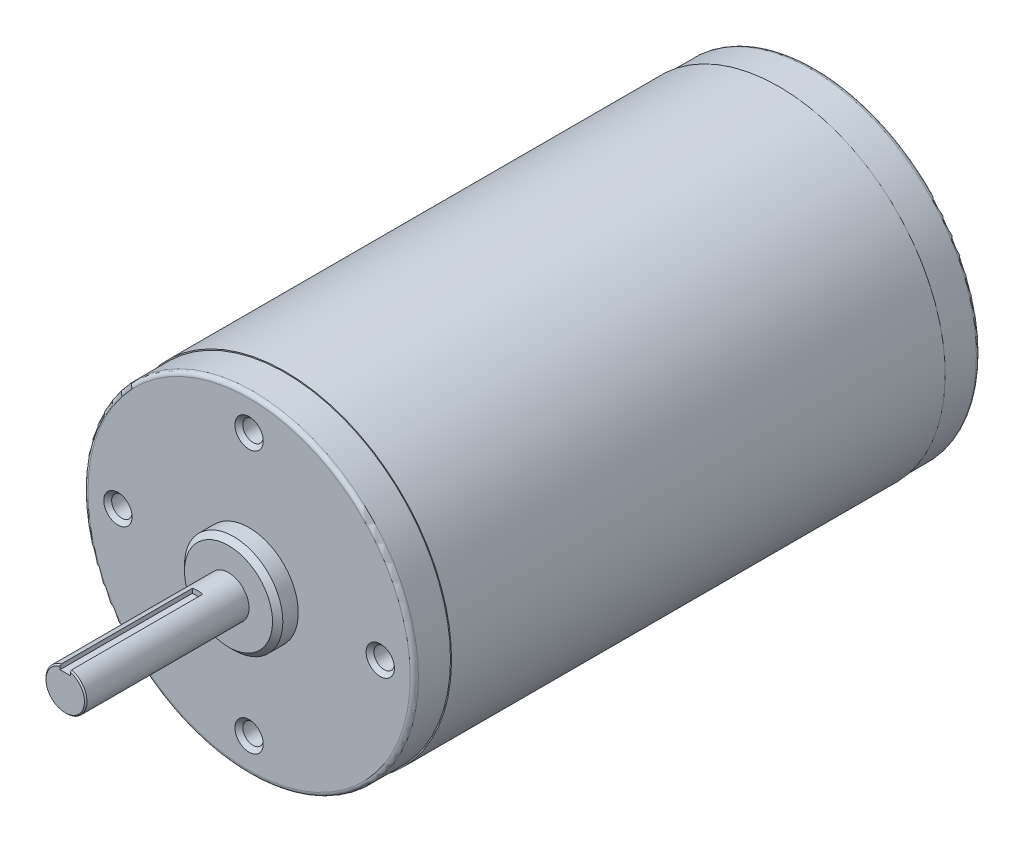
ISO-10303-21;
HEADER;
FILE_DESCRIPTION(('STEP AP214'),'2;1');
FILE_NAME('part.step','',(''),(''),'','','');
FILE_SCHEMA(('AUTOMOTIVE_DESIGN { 1 0 10303 214 1 1 1 1 }'));
ENDSEC;
DATA;
#1=APPLICATION_CONTEXT('core data for automotive mechanical design processes');
#2=APPLICATION_PROTOCOL_DEFINITION('international standard','automotive_design',2000,#1);
#3=PRODUCT_CONTEXT('',#1,'mechanical');
#4=PRODUCT('Part','Part','',(#3));
#5=PRODUCT_RELATED_PRODUCT_CATEGORY('part','',(#4));
#6=PRODUCT_DEFINITION_FORMATION('','',#4);
#7=PRODUCT_DEFINITION_CONTEXT('part definition',#1,'design');
#8=PRODUCT_DEFINITION('design','',#6,#7);
#9=PRODUCT_DEFINITION_SHAPE('','',#8);
#10=(LENGTH_UNIT() NAMED_UNIT(*) SI_UNIT(.MILLI.,.METRE.));
#11=(NAMED_UNIT(*) PLANE_ANGLE_UNIT() SI_UNIT($,.RADIAN.));
#12=(NAMED_UNIT(*) SI_UNIT($,.STERADIAN.) SOLID_ANGLE_UNIT());
#13=UNCERTAINTY_MEASURE_WITH_UNIT(LENGTH_MEASURE(1.E-05),#10,'distance_accuracy_value','');
#14=(GEOMETRIC_REPRESENTATION_CONTEXT(3) GLOBAL_UNCERTAINTY_ASSIGNED_CONTEXT((#13)) GLOBAL_UNIT_ASSIGNED_CONTEXT((#10,
#11,#12)) REPRESENTATION_CONTEXT('',''));
#15=CARTESIAN_POINT('',(0.,0.,0.));
#16=DIRECTION('',(0.,0.,1.));
#17=DIRECTION('',(1.,0.,0.));
#18=AXIS2_PLACEMENT_3D('',#15,#16,#17);
#19=CARTESIAN_POINT('',(15.74419,-15.74419,-106.7204));
#20=DIRECTION('',(0.,0.,-1.));
#21=DIRECTION('',(-1.,0.,0.));
#22=AXIS2_PLACEMENT_3D('',#19,#20,#21);
#23=PLANE('',#22);
#24=CARTESIAN_POINT('',(0.,0.,-106.7204));
#25=DIRECTION('',(0.,0.,1.));
#26=DIRECTION('',(-1.,0.,0.));
#27=AXIS2_PLACEMENT_3D('',#24,#25,#26);
#28=CIRCLE('',#27,14.3129);
#29=CARTESIAN_POINT('',(-14.3129,0.,-106.7204));
#30=VERTEX_POINT('',#29);
#31=EDGE_CURVE('E34',#30,#30,#28,.T.);
#32=ORIENTED_EDGE('',*,*,#31,.F.);
#33=EDGE_LOOP('',(#32));
#34=FACE_BOUND('',#33,.T.);
#35=ADVANCED_FACE('F17',(#34),#23,.T.);
#36=CARTESIAN_POINT('',(0.,0.,-105.9584));
#37=DIRECTION('',(0.,0.,-1.));
#38=DIRECTION('',(1.,0.,0.));
#39=AXIS2_PLACEMENT_3D('',#36,#37,#38);
#40=TOROIDAL_SURFACE('',#39,14.3129,0.762);
#41=CARTESIAN_POINT('',(0.,0.,-105.9584));
#42=DIRECTION('',(0.,0.,-1.));
#43=DIRECTION('',(1.,0.,0.));
#44=AXIS2_PLACEMENT_3D('',#41,#42,#43);
#45=CIRCLE('',#44,15.0749);
#46=CARTESIAN_POINT('',(15.0749,0.,-105.9584));
#47=VERTEX_POINT('',#46);
#48=EDGE_CURVE('E314',#47,#47,#45,.F.);
#49=ORIENTED_EDGE('',*,*,#48,.F.);
#50=EDGE_LOOP('',(#49));
#51=FACE_BOUND('',#50,.T.);
#52=ORIENTED_EDGE('',*,*,#31,.T.);
#53=EDGE_LOOP('',(#52));
#54=FACE_BOUND('',#53,.T.);
#55=ADVANCED_FACE('F333',(#51,#54),#40,.T.);
#56=CARTESIAN_POINT('',(0.,0.,-105.9584));
#57=DIRECTION('',(0.,0.,-1.));
#58=DIRECTION('',(0.,1.,0.));
#59=AXIS2_PLACEMENT_3D('',#56,#57,#58);
#60=CYLINDRICAL_SURFACE('',#59,15.0749);
#61=ORIENTED_EDGE('',*,*,#48,.T.);
#62=EDGE_LOOP('',(#61));
#63=FACE_BOUND('',#62,.T.);
#64=CARTESIAN_POINT('',(0.,0.,-102.6056));
#65=DIRECTION('',(0.,0.,-1.));
#66=DIRECTION('',(0.,1.,0.));
#67=AXIS2_PLACEMENT_3D('',#64,#65,#66);
#68=CIRCLE('',#67,15.0749);
#69=CARTESIAN_POINT('',(0.,15.0749,-102.6056));
#70=VERTEX_POINT('',#69);
#71=EDGE_CURVE('E21',#70,#70,#68,.F.);
#72=ORIENTED_EDGE('',*,*,#71,.F.);
#73=EDGE_LOOP('',(#72));
#74=FACE_BOUND('',#73,.T.);
#75=ADVANCED_FACE('F328',(#63,#74),#60,.T.);
#76=CARTESIAN_POINT('',(34.3662,-34.3662,-102.6056));
#77=DIRECTION('',(0.,0.,-1.));
#78=DIRECTION('',(-1.,0.,0.));
#79=AXIS2_PLACEMENT_3D('',#76,#77,#78);
#80=PLANE('',#79);
#81=CARTESIAN_POINT('',(0.,25.4,-102.6056));
#82=DIRECTION('',(0.,0.,-1.));
#83=DIRECTION('',(-1.,0.,0.));
#84=AXIS2_PLACEMENT_3D('',#81,#82,#83);
#85=CIRCLE('',#84,5.46099999999999);
#86=CARTESIAN_POINT('',(-5.46099999999998,25.4,-102.6056));
#87=VERTEX_POINT('',#86);
#88=EDGE_CURVE('E309',#87,#87,#85,.T.);
#89=ORIENTED_EDGE('',*,*,#88,.F.);
#90=EDGE_LOOP('',(#89));
#91=FACE_BOUND('',#90,.T.);
#92=ORIENTED_EDGE('',*,*,#71,.T.);
#93=EDGE_LOOP('',(#92));
#94=FACE_BOUND('',#93,.T.);
#95=CARTESIAN_POINT('',(0.,-25.4,-102.6056));
#96=DIRECTION('',(0.,0.,-1.));
#97=DIRECTION('',(-1.,0.,0.));
#98=AXIS2_PLACEMENT_3D('',#95,#96,#97);
#99=CIRCLE('',#98,5.46099999999999);
#100=CARTESIAN_POINT('',(-5.46099999999999,-25.4,-102.6056));
#101=VERTEX_POINT('',#100);
#102=EDGE_CURVE('E257',#101,#101,#99,.T.);
#103=ORIENTED_EDGE('',*,*,#102,.F.);
#104=EDGE_LOOP('',(#103));
#105=FACE_BOUND('',#104,.T.);
#106=CARTESIAN_POINT('',(0.,0.,-102.6056));
#107=DIRECTION('',(0.,0.,1.));
#108=DIRECTION('',(-1.,0.,0.));
#109=AXIS2_PLACEMENT_3D('',#106,#107,#108);
#110=CIRCLE('',#109,31.242);
#111=CARTESIAN_POINT('',(-31.242,0.,-102.6056));
#112=VERTEX_POINT('',#111);
#113=EDGE_CURVE('E224',#112,#112,#110,.T.);
#114=ORIENTED_EDGE('',*,*,#113,.F.);
#115=EDGE_LOOP('',(#114));
#116=FACE_BOUND('',#115,.T.);
#117=ADVANCED_FACE('F242',(#91,#94,#105,#116),#80,.T.);
#118=CARTESIAN_POINT('',(0.,0.,-101.8436));
#119=DIRECTION('',(0.,0.,-1.));
#120=DIRECTION('',(1.,0.,0.));
#121=AXIS2_PLACEMENT_3D('',#118,#119,#120);
#122=TOROIDAL_SURFACE('',#121,31.242,0.762);
#123=CARTESIAN_POINT('',(0.,0.,-101.8436));
#124=DIRECTION('',(0.,0.,-1.));
#125=DIRECTION('',(1.,0.,0.));
#126=AXIS2_PLACEMENT_3D('',#123,#124,#125);
#127=CIRCLE('',#126,32.004);
#128=CARTESIAN_POINT('',(32.004,0.,-101.8436));
#129=VERTEX_POINT('',#128);
#130=EDGE_CURVE('E253',#129,#129,#127,.F.);
#131=ORIENTED_EDGE('',*,*,#130,.F.);
#132=EDGE_LOOP('',(#131));
#133=FACE_BOUND('',#132,.T.);
#134=ORIENTED_EDGE('',*,*,#113,.T.);
#135=EDGE_LOOP('',(#134));
#136=FACE_BOUND('',#135,.T.);
#137=ADVANCED_FACE('F230',(#133,#136),#122,.T.);
#138=CARTESIAN_POINT('',(0.,25.4,-102.0976));
#139=DIRECTION('',(0.,0.,-1.));
#140=DIRECTION('',(-1.,0.,0.));
#141=AXIS2_PLACEMENT_3D('',#138,#139,#140);
#142=CONICAL_SURFACE('',#141,4.953,0.785398163397457);
#143=ORIENTED_EDGE('',*,*,#88,.T.);
#144=EDGE_LOOP('',(#143));
#145=FACE_BOUND('',#144,.T.);
#146=CARTESIAN_POINT('',(0.,25.4,-102.0976));
#147=DIRECTION('',(0.,0.,-1.));
#148=DIRECTION('',(-1.,0.,0.));
#149=AXIS2_PLACEMENT_3D('',#146,#147,#148);
#150=CIRCLE('',#149,4.953);
#151=CARTESIAN_POINT('',(-4.95299999999999,25.4,-102.0976));
#152=VERTEX_POINT('',#151);
#153=EDGE_CURVE('E256',#152,#152,#150,.T.);
#154=ORIENTED_EDGE('',*,*,#153,.F.);
#155=EDGE_LOOP('',(#154));
#156=FACE_BOUND('',#155,.T.);
#157=ADVANCED_FACE('F241',(#145,#156),#142,.F.);
#158=CARTESIAN_POINT('',(0.,-25.4,-102.0976));
#159=DIRECTION('',(0.,0.,-1.));
#160=DIRECTION('',(-1.,0.,0.));
#161=AXIS2_PLACEMENT_3D('',#158,#159,#160);
#162=CONICAL_SURFACE('',#161,4.953,0.785398163397457);
#163=ORIENTED_EDGE('',*,*,#102,.T.);
#164=EDGE_LOOP('',(#163));
#165=FACE_BOUND('',#164,.T.);
#166=CARTESIAN_POINT('',(0.,-25.4,-102.0976));
#167=DIRECTION('',(0.,0.,-1.));
#168=DIRECTION('',(-1.,0.,0.));
#169=AXIS2_PLACEMENT_3D('',#166,#167,#168);
#170=CIRCLE('',#169,4.953);
#171=CARTESIAN_POINT('',(-4.953,-25.4,-102.0976));
#172=VERTEX_POINT('',#171);
#173=EDGE_CURVE('E262',#172,#172,#170,.T.);
#174=ORIENTED_EDGE('',*,*,#173,.F.);
#175=EDGE_LOOP('',(#174));
#176=FACE_BOUND('',#175,.T.);
#177=ADVANCED_FACE('F337',(#165,#176),#162,.F.);
#178=CARTESIAN_POINT('',(0.,0.,-101.8436));
#179=DIRECTION('',(0.,0.,-1.));
#180=DIRECTION('',(-1.,0.,0.));
#181=AXIS2_PLACEMENT_3D('',#178,#179,#180);
#182=CYLINDRICAL_SURFACE('',#181,32.004);
#183=ORIENTED_EDGE('',*,*,#130,.T.);
#184=EDGE_LOOP('',(#183));
#185=FACE_BOUND('',#184,.T.);
#186=CARTESIAN_POINT('',(0.,0.,-95.6056));
#187=DIRECTION('',(0.,0.,-1.));
#188=DIRECTION('',(-1.,0.,0.));
#189=AXIS2_PLACEMENT_3D('',#186,#187,#188);
#190=CIRCLE('',#189,32.004);
#191=CARTESIAN_POINT('',(-32.004,0.,-95.6056));
#192=VERTEX_POINT('',#191);
#193=EDGE_CURVE('E267',#192,#192,#190,.F.);
#194=ORIENTED_EDGE('',*,*,#193,.F.);
#195=EDGE_LOOP('',(#194));
#196=FACE_BOUND('',#195,.T.);
#197=ADVANCED_FACE('F125',(#185,#196),#182,.T.);
#198=CARTESIAN_POINT('',(0.,25.4,-98.0336));
#199=DIRECTION('',(0.,0.,-1.));
#200=DIRECTION('',(-1.,0.,0.));
#201=AXIS2_PLACEMENT_3D('',#198,#199,#200);
#202=CYLINDRICAL_SURFACE('',#201,4.953);
#203=ORIENTED_EDGE('',*,*,#153,.T.);
#204=EDGE_LOOP('',(#203));
#205=FACE_BOUND('',#204,.T.);
#206=CARTESIAN_POINT('',(0.,25.4,-98.0336));
#207=DIRECTION('',(0.,0.,-1.));
#208=DIRECTION('',(-1.,0.,0.));
#209=AXIS2_PLACEMENT_3D('',#206,#207,#208);
#210=CIRCLE('',#209,4.953);
#211=CARTESIAN_POINT('',(-4.95299999999999,25.4,-98.0336));
#212=VERTEX_POINT('',#211);
#213=EDGE_CURVE('E303',#212,#212,#210,.T.);
#214=ORIENTED_EDGE('',*,*,#213,.F.);
#215=EDGE_LOOP('',(#214));
#216=FACE_BOUND('',#215,.T.);
#217=ADVANCED_FACE('F120',(#205,#216),#202,.F.);
#218=CARTESIAN_POINT('',(0.,-25.4,-98.0336));
#219=DIRECTION('',(0.,0.,-1.));
#220=DIRECTION('',(-1.,0.,0.));
#221=AXIS2_PLACEMENT_3D('',#218,#219,#220);
#222=CYLINDRICAL_SURFACE('',#221,4.953);
#223=ORIENTED_EDGE('',*,*,#173,.T.);
#224=EDGE_LOOP('',(#223));
#225=FACE_BOUND('',#224,.T.);
#226=CARTESIAN_POINT('',(0.,-25.4,-98.0336));
#227=DIRECTION('',(0.,0.,-1.));
#228=DIRECTION('',(-1.,0.,0.));
#229=AXIS2_PLACEMENT_3D('',#226,#227,#228);
#230=CIRCLE('',#229,4.953);
#231=CARTESIAN_POINT('',(-4.953,-25.4,-98.0336));
#232=VERTEX_POINT('',#231);
#233=EDGE_CURVE('E300',#232,#232,#230,.T.);
#234=ORIENTED_EDGE('',*,*,#233,.F.);
#235=EDGE_LOOP('',(#234));
#236=FACE_BOUND('',#235,.T.);
#237=ADVANCED_FACE('F124',(#225,#236),#222,.F.);
#238=CARTESIAN_POINT('',(35.42792,-35.42792,-95.6056));
#239=DIRECTION('',(0.,0.,-1.));
#240=DIRECTION('',(-1.,0.,0.));
#241=AXIS2_PLACEMENT_3D('',#238,#239,#240);
#242=PLANE('',#241);
#243=ORIENTED_EDGE('',*,*,#193,.T.);
#244=EDGE_LOOP('',(#243));
#245=FACE_BOUND('',#244,.T.);
#246=CARTESIAN_POINT('',(0.,0.,-95.6056));
#247=DIRECTION('',(0.,0.,-1.));
#248=DIRECTION('',(0.,1.,0.));
#249=AXIS2_PLACEMENT_3D('',#246,#247,#248);
#250=CIRCLE('',#249,32.2072);
#251=CARTESIAN_POINT('',(0.,32.2072,-95.6056));
#252=VERTEX_POINT('',#251);
#253=EDGE_CURVE('E297',#252,#252,#250,.F.);
#254=ORIENTED_EDGE('',*,*,#253,.F.);
#255=EDGE_LOOP('',(#254));
#256=FACE_BOUND('',#255,.T.);
#257=ADVANCED_FACE('F129',(#245,#256),#242,.T.);
#258=CARTESIAN_POINT('',(-4.953,30.45206,-98.0336));
#259=DIRECTION('',(0.,0.,-1.));
#260=DIRECTION('',(1.,0.,0.));
#261=AXIS2_PLACEMENT_3D('',#258,#259,#260);
#262=PLANE('',#261);
#263=CARTESIAN_POINT('',(0.,25.4,-98.0336));
#264=DIRECTION('',(0.,0.,-1.));
#265=DIRECTION('',(-1.,0.,0.));
#266=AXIS2_PLACEMENT_3D('',#263,#264,#265);
#267=CIRCLE('',#266,2.54);
#268=CARTESIAN_POINT('',(-2.53999999999999,25.4,-98.0336));
#269=VERTEX_POINT('',#268);
#270=EDGE_CURVE('E294',#269,#269,#267,.T.);
#271=ORIENTED_EDGE('',*,*,#270,.F.);
#272=EDGE_LOOP('',(#271));
#273=FACE_BOUND('',#272,.T.);
#274=ORIENTED_EDGE('',*,*,#213,.T.);
#275=EDGE_LOOP('',(#274));
#276=FACE_BOUND('',#275,.T.);
#277=ADVANCED_FACE('F131',(#273,#276),#262,.T.);
#278=CARTESIAN_POINT('',(4.953,-30.45206,-98.0336));
#279=DIRECTION('',(0.,0.,-1.));
#280=DIRECTION('',(-1.,0.,0.));
#281=AXIS2_PLACEMENT_3D('',#278,#279,#280);
#282=PLANE('',#281);
#283=CARTESIAN_POINT('',(0.,-25.4,-98.0336));
#284=DIRECTION('',(0.,0.,-1.));
#285=DIRECTION('',(-1.,0.,0.));
#286=AXIS2_PLACEMENT_3D('',#283,#284,#285);
#287=CIRCLE('',#286,2.54);
#288=CARTESIAN_POINT('',(-2.54,-25.4,-98.0336));
#289=VERTEX_POINT('',#288);
#290=EDGE_CURVE('E291',#289,#289,#287,.T.);
#291=ORIENTED_EDGE('',*,*,#290,.F.);
#292=EDGE_LOOP('',(#291));
#293=FACE_BOUND('',#292,.T.);
#294=ORIENTED_EDGE('',*,*,#233,.T.);
#295=EDGE_LOOP('',(#294));
#296=FACE_BOUND('',#295,.T.);
#297=ADVANCED_FACE('F134',(#293,#296),#282,.T.);
#298=CARTESIAN_POINT('',(0.,0.,-95.6056));
#299=DIRECTION('',(0.,0.,-1.));
#300=DIRECTION('',(0.,1.,0.));
#301=AXIS2_PLACEMENT_3D('',#298,#299,#300);
#302=CYLINDRICAL_SURFACE('',#301,32.2072);
#303=CARTESIAN_POINT('',(0.,0.,0.));
#304=DIRECTION('',(0.,0.,-1.));
#305=DIRECTION('',(0.,1.,0.));
#306=AXIS2_PLACEMENT_3D('',#303,#304,#305);
#307=CIRCLE('',#306,32.2072);
#308=CARTESIAN_POINT('',(0.,32.2072,0.));
#309=VERTEX_POINT('',#308);
#310=EDGE_CURVE('E274',#309,#309,#307,.F.);
#311=ORIENTED_EDGE('',*,*,#310,.F.);
#312=EDGE_LOOP('',(#311));
#313=FACE_BOUND('',#312,.T.);
#314=ORIENTED_EDGE('',*,*,#253,.T.);
#315=EDGE_LOOP('',(#314));
#316=FACE_BOUND('',#315,.T.);
#317=ADVANCED_FACE('F138',(#313,#316),#302,.T.);
#318=CARTESIAN_POINT('',(0.,25.4,-94.9856));
#319=DIRECTION('',(0.,0.,-1.));
#320=DIRECTION('',(-1.,0.,0.));
#321=AXIS2_PLACEMENT_3D('',#318,#319,#320);
#322=CYLINDRICAL_SURFACE('',#321,2.54);
#323=CARTESIAN_POINT('',(0.,25.4,-94.9856));
#324=DIRECTION('',(0.,0.,-1.));
#325=DIRECTION('',(-1.,0.,0.));
#326=AXIS2_PLACEMENT_3D('',#323,#324,#325);
#327=CIRCLE('',#326,2.53999999999998);
#328=CARTESIAN_POINT('',(-2.53999999999997,25.4,-94.9856));
#329=VERTEX_POINT('',#328);
#330=EDGE_CURVE('E270',#329,#329,#327,.T.);
#331=ORIENTED_EDGE('',*,*,#330,.F.);
#332=EDGE_LOOP('',(#331));
#333=FACE_BOUND('',#332,.T.);
#334=ORIENTED_EDGE('',*,*,#270,.T.);
#335=EDGE_LOOP('',(#334));
#336=FACE_BOUND('',#335,.T.);
#337=ADVANCED_FACE('F140',(#333,#336),#322,.F.);
#338=CARTESIAN_POINT('',(0.,-25.4,-94.9856));
#339=DIRECTION('',(0.,0.,-1.));
#340=DIRECTION('',(-1.,0.,0.));
#341=AXIS2_PLACEMENT_3D('',#338,#339,#340);
#342=CYLINDRICAL_SURFACE('',#341,2.54);
#343=CARTESIAN_POINT('',(0.,-25.4,-94.9856));
#344=DIRECTION('',(0.,0.,-1.));
#345=DIRECTION('',(-1.,0.,0.));
#346=AXIS2_PLACEMENT_3D('',#343,#344,#345);
#347=CIRCLE('',#346,2.53999999999998);
#348=CARTESIAN_POINT('',(-2.53999999999998,-25.4,-94.9856));
#349=VERTEX_POINT('',#348);
#350=EDGE_CURVE('E273',#349,#349,#347,.T.);
#351=ORIENTED_EDGE('',*,*,#350,.F.);
#352=EDGE_LOOP('',(#351));
#353=FACE_BOUND('',#352,.T.);
#354=ORIENTED_EDGE('',*,*,#290,.T.);
#355=EDGE_LOOP('',(#354));
#356=FACE_BOUND('',#355,.T.);
#357=ADVANCED_FACE('F143',(#353,#356),#342,.F.);
#358=CARTESIAN_POINT('',(-35.42792,-35.42792,0.));
#359=DIRECTION('',(0.,0.,1.));
#360=DIRECTION('',(1.,0.,0.));
#361=AXIS2_PLACEMENT_3D('',#358,#359,#360);
#362=PLANE('',#361);
#363=CARTESIAN_POINT('',(0.,0.,0.));
#364=DIRECTION('',(0.,0.,1.));
#365=DIRECTION('',(1.,0.,0.));
#366=AXIS2_PLACEMENT_3D('',#363,#364,#365);
#367=CIRCLE('',#366,32.004);
#368=CARTESIAN_POINT('',(32.004,0.,0.));
#369=VERTEX_POINT('',#368);
#370=EDGE_CURVE('E279',#369,#369,#367,.T.);
#371=ORIENTED_EDGE('',*,*,#370,.F.);
#372=EDGE_LOOP('',(#371));
#373=FACE_BOUND('',#372,.T.);
#374=ORIENTED_EDGE('',*,*,#310,.T.);
#375=EDGE_LOOP('',(#374));
#376=FACE_BOUND('',#375,.T.);
#377=ADVANCED_FACE('F147',(#373,#376),#362,.T.);
#378=CARTESIAN_POINT('',(0.,25.4,-94.6498390860874));
#379=DIRECTION('',(0.,0.,-1.));
#380=DIRECTION('',(-1.,0.,0.));
#381=AXIS2_PLACEMENT_3D('',#378,#379,#380);
#382=CONICAL_SURFACE('',#381,1.9812,1.02974425867662);
#383=ORIENTED_EDGE('',*,*,#330,.T.);
#384=EDGE_LOOP('',(#383));
#385=FACE_BOUND('',#384,.T.);
#386=CARTESIAN_POINT('',(0.,25.4,-94.6498390860874));
#387=DIRECTION('',(0.,0.,-1.));
#388=DIRECTION('',(-1.,0.,0.));
#389=AXIS2_PLACEMENT_3D('',#386,#387,#388);
#390=CIRCLE('',#389,1.9812);
#391=CARTESIAN_POINT('',(-1.9812,25.4,-94.6498390860874));
#392=VERTEX_POINT('',#391);
#393=EDGE_CURVE('E191',#392,#392,#390,.T.);
#394=ORIENTED_EDGE('',*,*,#393,.F.);
#395=EDGE_LOOP('',(#394));
#396=FACE_BOUND('',#395,.T.);
#397=ADVANCED_FACE('F149',(#385,#396),#382,.F.);
#398=CARTESIAN_POINT('',(23.22068,-2.17932,-95.6056));
#399=DIRECTION('',(0.,0.,1.));
#400=DIRECTION('',(1.,0.,0.));
#401=AXIS2_PLACEMENT_3D('',#398,#399,#400);
#402=PLANE('',#401);
#403=CARTESIAN_POINT('',(25.4,0.,-95.6056));
#404=DIRECTION('',(0.,0.,1.));
#405=DIRECTION('',(1.,0.,0.));
#406=AXIS2_PLACEMENT_3D('',#403,#404,#405);
#407=CIRCLE('',#406,1.9812);
#408=CARTESIAN_POINT('',(27.3812,0.,-95.6056));
#409=VERTEX_POINT('',#408);
#410=EDGE_CURVE('E185',#409,#409,#407,.F.);
#411=ORIENTED_EDGE('',*,*,#410,.F.);
#412=EDGE_LOOP('',(#411));
#413=FACE_BOUND('',#412,.T.);
#414=ADVANCED_FACE('F152',(#413),#402,.T.);
#415=CARTESIAN_POINT('',(0.,-25.4,-94.6498390860874));
#416=DIRECTION('',(0.,0.,-1.));
#417=DIRECTION('',(-1.,0.,0.));
#418=AXIS2_PLACEMENT_3D('',#415,#416,#417);
#419=CONICAL_SURFACE('',#418,1.9812,1.02974425867662);
#420=ORIENTED_EDGE('',*,*,#350,.T.);
#421=EDGE_LOOP('',(#420));
#422=FACE_BOUND('',#421,.T.);
#423=CARTESIAN_POINT('',(0.,-25.4,-94.6498390860874));
#424=DIRECTION('',(0.,0.,-1.));
#425=DIRECTION('',(-1.,0.,0.));
#426=AXIS2_PLACEMENT_3D('',#423,#424,#425);
#427=CIRCLE('',#426,1.9812);
#428=CARTESIAN_POINT('',(-1.98120000000001,-25.4,-94.6498390860874));
#429=VERTEX_POINT('',#428);
#430=EDGE_CURVE('E182',#429,#429,#427,.T.);
#431=ORIENTED_EDGE('',*,*,#430,.F.);
#432=EDGE_LOOP('',(#431));
#433=FACE_BOUND('',#432,.T.);
#434=ADVANCED_FACE('F154',(#422,#433),#419,.F.);
#435=CARTESIAN_POINT('',(-27.57932,-2.17932,0.));
#436=DIRECTION('',(0.,0.,1.));
#437=DIRECTION('',(1.,0.,0.));
#438=AXIS2_PLACEMENT_3D('',#435,#436,#437);
#439=PLANE('',#438);
#440=CARTESIAN_POINT('',(-25.4,0.,0.));
#441=DIRECTION('',(0.,0.,1.));
#442=DIRECTION('',(1.,0.,0.));
#443=AXIS2_PLACEMENT_3D('',#440,#441,#442);
#444=CIRCLE('',#443,1.9812);
#445=CARTESIAN_POINT('',(-23.4188,0.,0.));
#446=VERTEX_POINT('',#445);
#447=EDGE_CURVE('E184',#446,#446,#444,.F.);
#448=ORIENTED_EDGE('',*,*,#447,.F.);
#449=EDGE_LOOP('',(#448));
#450=FACE_BOUND('',#449,.T.);
#451=ADVANCED_FACE('F157',(#450),#439,.T.);
#452=CARTESIAN_POINT('',(0.,0.,6.20625));
#453=DIRECTION('',(0.,0.,1.));
#454=DIRECTION('',(1.,0.,0.));
#455=AXIS2_PLACEMENT_3D('',#452,#453,#454);
#456=CYLINDRICAL_SURFACE('',#455,32.004);
#457=CARTESIAN_POINT('',(0.,0.,6.20625));
#458=DIRECTION('',(0.,0.,1.));
#459=DIRECTION('',(-1.,0.,0.));
#460=AXIS2_PLACEMENT_3D('',#457,#458,#459);
#461=CIRCLE('',#460,32.004);
#462=CARTESIAN_POINT('',(-32.004,0.,6.20625));
#463=VERTEX_POINT('',#462);
#464=EDGE_CURVE('E188',#463,#463,#461,.T.);
#465=ORIENTED_EDGE('',*,*,#464,.F.);
#466=EDGE_LOOP('',(#465));
#467=FACE_BOUND('',#466,.T.);
#468=ORIENTED_EDGE('',*,*,#370,.T.);
#469=EDGE_LOOP('',(#468));
#470=FACE_BOUND('',#469,.T.);
#471=ADVANCED_FACE('F163',(#467,#470),#456,.T.);
#472=CARTESIAN_POINT('',(0.,25.4,-94.6498390860874));
#473=DIRECTION('',(0.,0.,1.));
#474=DIRECTION('',(1.,0.,0.));
#475=AXIS2_PLACEMENT_3D('',#472,#473,#474);
#476=CYLINDRICAL_SURFACE('',#475,1.9812);
#477=CARTESIAN_POINT('',(0.,25.4,6.23799999999999));
#478=DIRECTION('',(0.,0.,1.));
#479=DIRECTION('',(0.,-1.,0.));
#480=AXIS2_PLACEMENT_3D('',#477,#478,#479);
#481=CIRCLE('',#480,1.9812);
#482=CARTESIAN_POINT('',(0.,23.4188,6.23799999999999));
#483=VERTEX_POINT('',#482);
#484=EDGE_CURVE('E374',#483,#483,#481,.F.);
#485=ORIENTED_EDGE('',*,*,#484,.F.);
#486=EDGE_LOOP('',(#485));
#487=FACE_BOUND('',#486,.T.);
#488=ORIENTED_EDGE('',*,*,#393,.T.);
#489=EDGE_LOOP('',(#488));
#490=FACE_BOUND('',#489,.T.);
#491=ADVANCED_FACE('F159',(#487,#490),#476,.F.);
#492=CARTESIAN_POINT('',(25.4,0.,-95.6056));
#493=DIRECTION('',(0.,0.,1.));
#494=DIRECTION('',(1.,0.,0.));
#495=AXIS2_PLACEMENT_3D('',#492,#493,#494);
#496=CYLINDRICAL_SURFACE('',#495,1.9812);
#497=CARTESIAN_POINT('',(25.4,0.,6.23799999999999));
#498=DIRECTION('',(0.,0.,1.));
#499=DIRECTION('',(-1.,0.,0.));
#500=AXIS2_PLACEMENT_3D('',#497,#498,#499);
#501=CIRCLE('',#500,1.9812);
#502=CARTESIAN_POINT('',(23.4188,0.,6.23799999999999));
#503=VERTEX_POINT('',#502);
#504=EDGE_CURVE('E376',#503,#503,#501,.F.);
#505=ORIENTED_EDGE('',*,*,#504,.F.);
#506=EDGE_LOOP('',(#505));
#507=FACE_BOUND('',#506,.T.);
#508=ORIENTED_EDGE('',*,*,#410,.T.);
#509=EDGE_LOOP('',(#508));
#510=FACE_BOUND('',#509,.T.);
#511=ADVANCED_FACE('F162',(#507,#510),#496,.F.);
#512=CARTESIAN_POINT('',(0.,-25.4,-94.6498390860874));
#513=DIRECTION('',(0.,0.,1.));
#514=DIRECTION('',(1.,0.,0.));
#515=AXIS2_PLACEMENT_3D('',#512,#513,#514);
#516=CYLINDRICAL_SURFACE('',#515,1.9812);
#517=CARTESIAN_POINT('',(0.,-25.4,6.23799999999999));
#518=DIRECTION('',(0.,0.,1.));
#519=DIRECTION('',(0.,1.,0.));
#520=AXIS2_PLACEMENT_3D('',#517,#518,#519);
#521=CIRCLE('',#520,1.9812);
#522=CARTESIAN_POINT('',(0.,-23.4188,6.23799999999999));
#523=VERTEX_POINT('',#522);
#524=EDGE_CURVE('E179',#523,#523,#521,.F.);
#525=ORIENTED_EDGE('',*,*,#524,.F.);
#526=EDGE_LOOP('',(#525));
#527=FACE_BOUND('',#526,.T.);
#528=ORIENTED_EDGE('',*,*,#430,.T.);
#529=EDGE_LOOP('',(#528));
#530=FACE_BOUND('',#529,.T.);
#531=ADVANCED_FACE('F166',(#527,#530),#516,.F.);
#532=CARTESIAN_POINT('',(-25.4,0.,0.));
#533=DIRECTION('',(0.,0.,1.));
#534=DIRECTION('',(1.,0.,0.));
#535=AXIS2_PLACEMENT_3D('',#532,#533,#534);
#536=CYLINDRICAL_SURFACE('',#535,1.9812);
#537=CARTESIAN_POINT('',(-25.4,0.,6.23799999999999));
#538=DIRECTION('',(0.,0.,1.));
#539=DIRECTION('',(1.,0.,0.));
#540=AXIS2_PLACEMENT_3D('',#537,#538,#539);
#541=CIRCLE('',#540,1.9812);
#542=CARTESIAN_POINT('',(-23.4188,0.,6.23799999999999));
#543=VERTEX_POINT('',#542);
#544=EDGE_CURVE('E389',#543,#543,#541,.F.);
#545=ORIENTED_EDGE('',*,*,#544,.F.);
#546=EDGE_LOOP('',(#545));
#547=FACE_BOUND('',#546,.T.);
#548=ORIENTED_EDGE('',*,*,#447,.T.);
#549=EDGE_LOOP('',(#548));
#550=FACE_BOUND('',#549,.T.);
#551=ADVANCED_FACE('F19',(#547,#550),#536,.F.);
#552=CARTESIAN_POINT('',(0.,0.,6.20625));
#553=DIRECTION('',(0.,0.,1.));
#554=DIRECTION('',(-1.,0.,0.));
#555=AXIS2_PLACEMENT_3D('',#552,#553,#554);
#556=TOROIDAL_SURFACE('',#555,31.21025,0.79375);
#557=ORIENTED_EDGE('',*,*,#464,.T.);
#558=EDGE_LOOP('',(#557));
#559=FACE_BOUND('',#558,.T.);
#560=CARTESIAN_POINT('',(0.,0.,7.));
#561=DIRECTION('',(0.,0.,-1.));
#562=DIRECTION('',(1.,0.,0.));
#563=AXIS2_PLACEMENT_3D('',#560,#561,#562);
#564=CIRCLE('',#563,31.21025);
#565=CARTESIAN_POINT('',(31.21025,0.,7.));
#566=VERTEX_POINT('',#565);
#567=EDGE_CURVE('E76',#566,#566,#564,.F.);
#568=ORIENTED_EDGE('',*,*,#567,.F.);
#569=EDGE_LOOP('',(#568));
#570=FACE_BOUND('',#569,.T.);
#571=ADVANCED_FACE('F174',(#559,#570),#556,.T.);
#572=CARTESIAN_POINT('',(0.,25.4,6.23799999999999));
#573=DIRECTION('',(0.,0.,1.));
#574=DIRECTION('',(1.,0.,0.));
#575=AXIS2_PLACEMENT_3D('',#572,#573,#574);
#576=CONICAL_SURFACE('',#575,1.9812,0.785398163397445);
#577=CARTESIAN_POINT('',(0.,25.4,7.));
#578=DIRECTION('',(0.,0.,1.));
#579=DIRECTION('',(1.,0.,0.));
#580=AXIS2_PLACEMENT_3D('',#577,#578,#579);
#581=CIRCLE('',#580,2.7432);
#582=CARTESIAN_POINT('',(2.74320000000001,25.4,7.));
#583=VERTEX_POINT('',#582);
#584=EDGE_CURVE('E703',#583,#583,#581,.F.);
#585=ORIENTED_EDGE('',*,*,#584,.F.);
#586=EDGE_LOOP('',(#585));
#587=FACE_BOUND('',#586,.T.);
#588=ORIENTED_EDGE('',*,*,#484,.T.);
#589=EDGE_LOOP('',(#588));
#590=FACE_BOUND('',#589,.T.);
#591=ADVANCED_FACE('F207',(#587,#590),#576,.F.);
#592=CARTESIAN_POINT('',(25.4,0.,6.23799999999999));
#593=DIRECTION('',(0.,0.,1.));
#594=DIRECTION('',(1.,0.,0.));
#595=AXIS2_PLACEMENT_3D('',#592,#593,#594);
#596=CONICAL_SURFACE('',#595,1.9812,0.785398163397445);
#597=CARTESIAN_POINT('',(25.4,0.,7.));
#598=DIRECTION('',(0.,0.,1.));
#599=DIRECTION('',(1.,0.,0.));
#600=AXIS2_PLACEMENT_3D('',#597,#598,#599);
#601=CIRCLE('',#600,2.7432);
#602=CARTESIAN_POINT('',(28.1432,0.,7.));
#603=VERTEX_POINT('',#602);
#604=EDGE_CURVE('E698',#603,#603,#601,.F.);
#605=ORIENTED_EDGE('',*,*,#604,.F.);
#606=EDGE_LOOP('',(#605));
#607=FACE_BOUND('',#606,.T.);
#608=ORIENTED_EDGE('',*,*,#504,.T.);
#609=EDGE_LOOP('',(#608));
#610=FACE_BOUND('',#609,.T.);
#611=ADVANCED_FACE('F574',(#607,#610),#596,.F.);
#612=CARTESIAN_POINT('',(0.,-25.4,6.23799999999999));
#613=DIRECTION('',(0.,0.,1.));
#614=DIRECTION('',(1.,0.,0.));
#615=AXIS2_PLACEMENT_3D('',#612,#613,#614);
#616=CONICAL_SURFACE('',#615,1.9812,0.785398163397445);
#617=CARTESIAN_POINT('',(0.,-25.4,7.));
#618=DIRECTION('',(0.,0.,1.));
#619=DIRECTION('',(1.,0.,0.));
#620=AXIS2_PLACEMENT_3D('',#617,#618,#619);
#621=CIRCLE('',#620,2.7432);
#622=CARTESIAN_POINT('',(2.7432,-25.4,7.));
#623=VERTEX_POINT('',#622);
#624=EDGE_CURVE('E695',#623,#623,#621,.F.);
#625=ORIENTED_EDGE('',*,*,#624,.F.);
#626=EDGE_LOOP('',(#625));
#627=FACE_BOUND('',#626,.T.);
#628=ORIENTED_EDGE('',*,*,#524,.T.);
#629=EDGE_LOOP('',(#628));
#630=FACE_BOUND('',#629,.T.);
#631=ADVANCED_FACE('F581',(#627,#630),#616,.F.);
#632=CARTESIAN_POINT('',(-25.4,0.,6.23799999999999));
#633=DIRECTION('',(0.,0.,1.));
#634=DIRECTION('',(1.,0.,0.));
#635=AXIS2_PLACEMENT_3D('',#632,#633,#634);
#636=CONICAL_SURFACE('',#635,1.9812,0.785398163397445);
#637=CARTESIAN_POINT('',(-25.4,0.,7.));
#638=DIRECTION('',(0.,0.,1.));
#639=DIRECTION('',(1.,0.,0.));
#640=AXIS2_PLACEMENT_3D('',#637,#638,#639);
#641=CIRCLE('',#640,2.7432);
#642=CARTESIAN_POINT('',(-22.6568,0.,7.));
#643=VERTEX_POINT('',#642);
#644=EDGE_CURVE('E693',#643,#643,#641,.F.);
#645=ORIENTED_EDGE('',*,*,#644,.F.);
#646=EDGE_LOOP('',(#645));
#647=FACE_BOUND('',#646,.T.);
#648=ORIENTED_EDGE('',*,*,#544,.T.);
#649=EDGE_LOOP('',(#648));
#650=FACE_BOUND('',#649,.T.);
#651=ADVANCED_FACE('F413',(#647,#650),#636,.F.);
#652=CARTESIAN_POINT('',(-34.331275,-34.331275,7.));
#653=DIRECTION('',(0.,0.,1.));
#654=DIRECTION('',(1.,0.,0.));
#655=AXIS2_PLACEMENT_3D('',#652,#653,#654);
#656=PLANE('',#655);
#657=ORIENTED_EDGE('',*,*,#644,.T.);
#658=EDGE_LOOP('',(#657));
#659=FACE_BOUND('',#658,.T.);
#660=ORIENTED_EDGE('',*,*,#624,.T.);
#661=EDGE_LOOP('',(#660));
#662=FACE_BOUND('',#661,.T.);
#663=CARTESIAN_POINT('',(0.,0.,7.));
#664=DIRECTION('',(0.,0.,1.));
#665=DIRECTION('',(0.,-1.,0.));
#666=AXIS2_PLACEMENT_3D('',#663,#664,#665);
#667=CIRCLE('',#666,9.525);
#668=CARTESIAN_POINT('',(0.,-9.525,7.));
#669=VERTEX_POINT('',#668);
#670=EDGE_CURVE('E97',#669,#669,#667,.T.);
#671=ORIENTED_EDGE('',*,*,#670,.F.);
#672=EDGE_LOOP('',(#671));
#673=FACE_BOUND('',#672,.T.);
#674=ORIENTED_EDGE('',*,*,#604,.T.);
#675=EDGE_LOOP('',(#674));
#676=FACE_BOUND('',#675,.T.);
#677=ORIENTED_EDGE('',*,*,#584,.T.);
#678=EDGE_LOOP('',(#677));
#679=FACE_BOUND('',#678,.T.);
#680=ORIENTED_EDGE('',*,*,#567,.T.);
#681=EDGE_LOOP('',(#680));
#682=FACE_BOUND('',#681,.T.);
#683=ADVANCED_FACE('F402',(#659,#662,#673,#676,#679,#682),#656,.T.);
#684=CARTESIAN_POINT('',(0.,0.,9.9878));
#685=DIRECTION('',(0.,0.,1.));
#686=DIRECTION('',(0.,-1.,0.));
#687=AXIS2_PLACEMENT_3D('',#684,#685,#686);
#688=CYLINDRICAL_SURFACE('',#687,9.525);
#689=CARTESIAN_POINT('',(0.,0.,9.9878));
#690=DIRECTION('',(0.,0.,-1.));
#691=DIRECTION('',(-1.,0.,0.));
#692=AXIS2_PLACEMENT_3D('',#689,#690,#691);
#693=CIRCLE('',#692,9.525);
#694=CARTESIAN_POINT('',(-9.525,0.,9.9878));
#695=VERTEX_POINT('',#694);
#696=EDGE_CURVE('E94',#695,#695,#693,.F.);
#697=ORIENTED_EDGE('',*,*,#696,.F.);
#698=EDGE_LOOP('',(#697));
#699=FACE_BOUND('',#698,.T.);
#700=ORIENTED_EDGE('',*,*,#670,.T.);
#701=EDGE_LOOP('',(#700));
#702=FACE_BOUND('',#701,.T.);
#703=ADVANCED_FACE('F412',(#699,#702),#688,.T.);
#704=CARTESIAN_POINT('',(0.,0.,9.9878));
#705=DIRECTION('',(0.,0.,-1.));
#706=DIRECTION('',(0.,1.,0.));
#707=AXIS2_PLACEMENT_3D('',#704,#705,#706);
#708=CONICAL_SURFACE('',#707,9.525,0.785398163397448);
#709=ORIENTED_EDGE('',*,*,#696,.T.);
#710=EDGE_LOOP('',(#709));
#711=FACE_BOUND('',#710,.T.);
#712=CARTESIAN_POINT('',(0.,0.,10.9878));
#713=DIRECTION('',(0.,0.,-1.));
#714=DIRECTION('',(0.,1.,0.));
#715=AXIS2_PLACEMENT_3D('',#712,#713,#714);
#716=CIRCLE('',#715,8.525);
#717=CARTESIAN_POINT('',(0.,8.525,10.9878));
#718=VERTEX_POINT('',#717);
#719=EDGE_CURVE('E429',#718,#718,#716,.F.);
#720=ORIENTED_EDGE('',*,*,#719,.F.);
#721=EDGE_LOOP('',(#720));
#722=FACE_BOUND('',#721,.T.);
#723=ADVANCED_FACE('F417',(#711,#722),#708,.T.);
#724=CARTESIAN_POINT('',(-1.,2.95763693175404,43.89223));
#725=DIRECTION('',(1.,0.,0.));
#726=DIRECTION('',(0.,0.,-1.));
#727=AXIS2_PLACEMENT_3D('',#724,#725,#726);
#728=PLANE('',#727);
#729=DIRECTION('',(0.,1.,0.));
#730=VECTOR('',#729,1.);
#731=CARTESIAN_POINT('',(-1.,2.95132433409503,16.9822));
#732=LINE('',#731,#730);
#733=CARTESIAN_POINT('',(-0.999999999999999,3.84726136491921,16.9822));
#734=VERTEX_POINT('',#733);
#735=CARTESIAN_POINT('',(-1.,3.,16.9822));
#736=VERTEX_POINT('',#735);
#737=EDGE_CURVE('E88',#734,#736,#732,.F.);
#738=ORIENTED_EDGE('',*,*,#737,.F.);
#739=DIRECTION('',(0.,0.,-1.));
#740=VECTOR('',#739,1.);
#741=CARTESIAN_POINT('',(-0.999999999999999,3.84726136491921,26.6743));
#742=LINE('',#741,#740);
#743=CARTESIAN_POINT('',(-0.999999999999999,3.84726136491921,42.3608));
#744=VERTEX_POINT('',#743);
#745=EDGE_CURVE('E92',#744,#734,#742,.T.);
#746=ORIENTED_EDGE('',*,*,#745,.F.);
#747=CARTESIAN_POINT('',(-1.,3.84726136491921,42.3608));
#748=CARTESIAN_POINT('',(-1.,3.80416108607925,42.4025173690102));
#749=CARTESIAN_POINT('',(-1.,3.76103632688832,42.4442093866154));
#750=CARTESIAN_POINT('',(-1.,3.67473784683734,42.5275427199498));
#751=CARTESIAN_POINT('',(-1.,3.63156412597619,42.569184035678));
#752=CARTESIAN_POINT('',(-1.,3.58836592476298,42.6108));
#753=B_SPLINE_CURVE_WITH_KNOTS('',3,(#747,#748,#749,#750,#751,#752),.UNSPECIFIED.,.F.,.F.,(4,2,
4),(0.,0.179949222519613,0.359898449072815),.UNSPECIFIED.);
#754=CARTESIAN_POINT('',(-1.,3.58836592476299,42.6108));
#755=VERTEX_POINT('',#754);
#756=EDGE_CURVE('E59',#744,#755,#753,.T.);
#757=ORIENTED_EDGE('',*,*,#756,.T.);
#758=DIRECTION('',(0.,1.,0.));
#759=VECTOR('',#758,1.);
#760=CARTESIAN_POINT('',(-1.,2.95763693175404,42.6108));
#761=LINE('',#760,#759);
#762=CARTESIAN_POINT('',(-1.,3.,42.6108));
#763=VERTEX_POINT('',#762);
#764=EDGE_CURVE('E66',#755,#763,#761,.F.);
#765=ORIENTED_EDGE('',*,*,#764,.T.);
#766=DIRECTION('',(0.,0.,1.));
#767=VECTOR('',#766,1.);
#768=CARTESIAN_POINT('',(-1.,3.,15.70077));
#769=LINE('',#768,#767);
#770=EDGE_CURVE('E434',#736,#763,#769,.T.);
#771=ORIENTED_EDGE('',*,*,#770,.F.);
#772=EDGE_LOOP('',(#738,#746,#757,#765,#771));
#773=FACE_BOUND('',#772,.T.);
#774=ADVANCED_FACE('F90',(#773),#728,.T.);
#775=CARTESIAN_POINT('',(-1.1,2.95132433409503,16.9822));
#776=DIRECTION('',(0.,0.,1.));
#777=DIRECTION('',(1.,0.,0.));
#778=AXIS2_PLACEMENT_3D('',#775,#776,#777);
#779=PLANE('',#778);
#780=CARTESIAN_POINT('',(0.,0.,16.9822));
#781=DIRECTION('',(0.,0.,1.));
#782=DIRECTION('',(1.,0.,0.));
#783=AXIS2_PLACEMENT_3D('',#780,#781,#782);
#784=CIRCLE('',#783,3.9751);
#785=CARTESIAN_POINT('',(1.,3.84726136491921,16.9822));
#786=VERTEX_POINT('',#785);
#787=EDGE_CURVE('E439',#734,#786,#784,.F.);
#788=ORIENTED_EDGE('',*,*,#787,.F.);
#789=ORIENTED_EDGE('',*,*,#737,.T.);
#790=DIRECTION('',(1.,0.,0.));
#791=VECTOR('',#790,1.);
#792=CARTESIAN_POINT('',(-1.1,3.,16.9822));
#793=LINE('',#792,#791);
#794=CARTESIAN_POINT('',(1.,3.,16.9822));
#795=VERTEX_POINT('',#794);
#796=EDGE_CURVE('E431',#795,#736,#793,.F.);
#797=ORIENTED_EDGE('',*,*,#796,.F.);
#798=DIRECTION('',(0.,1.,0.));
#799=VECTOR('',#798,1.);
#800=CARTESIAN_POINT('',(1.,2.95763693175404,16.9822));
#801=LINE('',#800,#799);
#802=EDGE_CURVE('E436',#786,#795,#801,.F.);
#803=ORIENTED_EDGE('',*,*,#802,.F.);
#804=EDGE_LOOP('',(#788,#789,#797,#803));
#805=FACE_BOUND('',#804,.T.);
#806=ADVANCED_FACE('F424',(#805),#779,.T.);
#807=CARTESIAN_POINT('',(1.,2.95763693175404,15.70077));
#808=DIRECTION('',(-1.,0.,0.));
#809=DIRECTION('',(0.,0.,1.));
#810=AXIS2_PLACEMENT_3D('',#807,#808,#809);
#811=PLANE('',#810);
#812=DIRECTION('',(0.,0.,1.));
#813=VECTOR('',#812,1.);
#814=CARTESIAN_POINT('',(1.,3.,15.70077));
#815=LINE('',#814,#813);
#816=CARTESIAN_POINT('',(1.,3.,42.6108));
#817=VERTEX_POINT('',#816);
#818=EDGE_CURVE('E675',#817,#795,#815,.F.);
#819=ORIENTED_EDGE('',*,*,#818,.F.);
#820=DIRECTION('',(0.,1.,0.));
#821=VECTOR('',#820,1.);
#822=CARTESIAN_POINT('',(1.,2.95763693175404,42.6108));
#823=LINE('',#822,#821);
#824=CARTESIAN_POINT('',(1.,3.58836592476298,42.6108));
#825=VERTEX_POINT('',#824);
#826=EDGE_CURVE('E432',#817,#825,#823,.T.);
#827=ORIENTED_EDGE('',*,*,#826,.T.);
#828=CARTESIAN_POINT('',(1.,3.58836592476298,42.6108));
#829=CARTESIAN_POINT('',(1.,3.63156412597619,42.569184035678));
#830=CARTESIAN_POINT('',(1.,3.67473784683734,42.5275427199498));
#831=CARTESIAN_POINT('',(1.,3.76103632688832,42.4442093866154));
#832=CARTESIAN_POINT('',(1.,3.80416108607924,42.4025173690102));
#833=CARTESIAN_POINT('',(1.,3.84726136491921,42.3608));
#834=B_SPLINE_CURVE_WITH_KNOTS('',3,(#828,#829,#830,#831,#832,#833),.UNSPECIFIED.,.F.,.F.,(4,2,
4),(0.,0.179949226553203,0.359898449072809),.UNSPECIFIED.);
#835=CARTESIAN_POINT('',(1.,3.84726136491921,42.3608));
#836=VERTEX_POINT('',#835);
#837=EDGE_CURVE('E81',#825,#836,#834,.T.);
#838=ORIENTED_EDGE('',*,*,#837,.T.);
#839=DIRECTION('',(0.,0.,1.));
#840=VECTOR('',#839,1.);
#841=CARTESIAN_POINT('',(1.,3.84726136491921,26.6743));
#842=LINE('',#841,#840);
#843=EDGE_CURVE('E442',#786,#836,#842,.T.);
#844=ORIENTED_EDGE('',*,*,#843,.F.);
#845=ORIENTED_EDGE('',*,*,#802,.T.);
#846=EDGE_LOOP('',(#819,#827,#838,#844,#845));
#847=FACE_BOUND('',#846,.T.);
#848=ADVANCED_FACE('F614',(#847),#811,.T.);
#849=CARTESIAN_POINT('',(-9.3775,-9.3775,10.9878));
#850=DIRECTION('',(0.,0.,1.));
#851=DIRECTION('',(1.,0.,0.));
#852=AXIS2_PLACEMENT_3D('',#849,#850,#851);
#853=PLANE('',#852);
#854=CARTESIAN_POINT('',(0.,0.,10.9878));
#855=DIRECTION('',(0.,0.,1.));
#856=DIRECTION('',(1.,0.,0.));
#857=AXIS2_PLACEMENT_3D('',#854,#855,#856);
#858=CIRCLE('',#857,3.9751);
#859=CARTESIAN_POINT('',(3.9751,0.,10.9878));
#860=VERTEX_POINT('',#859);
#861=EDGE_CURVE('E443',#860,#860,#858,.T.);
#862=ORIENTED_EDGE('',*,*,#861,.F.);
#863=EDGE_LOOP('',(#862));
#864=FACE_BOUND('',#863,.T.);
#865=ORIENTED_EDGE('',*,*,#719,.T.);
#866=EDGE_LOOP('',(#865));
#867=FACE_BOUND('',#866,.T.);
#868=ADVANCED_FACE('F621',(#864,#867),#853,.T.);
#869=CARTESIAN_POINT('',(-1.1,3.,15.70077));
#870=DIRECTION('',(0.,1.,0.));
#871=DIRECTION('',(0.,0.,1.));
#872=AXIS2_PLACEMENT_3D('',#869,#870,#871);
#873=PLANE('',#872);
#874=DIRECTION('',(1.,0.,0.));
#875=VECTOR('',#874,1.);
#876=CARTESIAN_POINT('',(-4.0970631821133,3.,42.6108));
#877=LINE('',#876,#875);
#878=EDGE_CURVE('E87',#817,#763,#877,.F.);
#879=ORIENTED_EDGE('',*,*,#878,.F.);
#880=ORIENTED_EDGE('',*,*,#818,.T.);
#881=ORIENTED_EDGE('',*,*,#796,.T.);
#882=ORIENTED_EDGE('',*,*,#770,.T.);
#883=EDGE_LOOP('',(#879,#880,#881,#882));
#884=FACE_BOUND('',#883,.T.);
#885=ADVANCED_FACE('F628',(#884),#873,.T.);
#886=CARTESIAN_POINT('',(0.,0.,42.3608));
#887=DIRECTION('',(0.,0.,1.));
#888=DIRECTION('',(1.,0.,0.));
#889=AXIS2_PLACEMENT_3D('',#886,#887,#888);
#890=CYLINDRICAL_SURFACE('',#889,3.9751);
#891=ORIENTED_EDGE('',*,*,#861,.T.);
#892=EDGE_LOOP('',(#891));
#893=FACE_BOUND('',#892,.T.);
#894=ORIENTED_EDGE('',*,*,#787,.T.);
#895=ORIENTED_EDGE('',*,*,#843,.T.);
#896=CARTESIAN_POINT('',(0.,0.,42.3608));
#897=DIRECTION('',(0.,0.,-1.));
#898=DIRECTION('',(-1.,0.,0.));
#899=AXIS2_PLACEMENT_3D('',#896,#897,#898);
#900=CIRCLE('',#899,3.97510000000001);
#901=EDGE_CURVE('E27',#744,#836,#900,.F.);
#902=ORIENTED_EDGE('',*,*,#901,.F.);
#903=ORIENTED_EDGE('',*,*,#745,.T.);
#904=EDGE_LOOP('',(#894,#895,#902,#903));
#905=FACE_BOUND('',#904,.T.);
#906=ADVANCED_FACE('F636',(#893,#905),#890,.T.);
#907=CARTESIAN_POINT('',(-4.0970631821133,-4.08010568747069,42.6108));
#908=DIRECTION('',(0.,0.,1.));
#909=DIRECTION('',(1.,0.,0.));
#910=AXIS2_PLACEMENT_3D('',#907,#908,#909);
#911=PLANE('',#910);
#912=ORIENTED_EDGE('',*,*,#764,.F.);
#913=CARTESIAN_POINT('',(0.,0.,42.6108));
#914=DIRECTION('',(0.,0.,-1.));
#915=DIRECTION('',(-1.,0.,0.));
#916=AXIS2_PLACEMENT_3D('',#913,#914,#915);
#917=CIRCLE('',#916,3.72510000000001);
#918=EDGE_CURVE('E11',#825,#755,#917,.T.);
#919=ORIENTED_EDGE('',*,*,#918,.F.);
#920=ORIENTED_EDGE('',*,*,#826,.F.);
#921=ORIENTED_EDGE('',*,*,#878,.T.);
#922=EDGE_LOOP('',(#912,#919,#920,#921));
#923=FACE_BOUND('',#922,.T.);
#924=ADVANCED_FACE('F85',(#923),#911,.T.);
#925=CARTESIAN_POINT('',(0.,0.,42.3608));
#926=DIRECTION('',(0.,0.,-1.));
#927=DIRECTION('',(-1.,0.,0.));
#928=AXIS2_PLACEMENT_3D('',#925,#926,#927);
#929=CONICAL_SURFACE('',#928,3.97510000000001,0.785398163397441);
#930=ORIENTED_EDGE('',*,*,#918,.T.);
#931=ORIENTED_EDGE('',*,*,#756,.F.);
#932=ORIENTED_EDGE('',*,*,#901,.T.);
#933=ORIENTED_EDGE('',*,*,#837,.F.);
#934=EDGE_LOOP('',(#930,#931,#932,#933));
#935=FACE_BOUND('',#934,.T.);
#936=ADVANCED_FACE('F79',(#935),#929,.T.);
#937=CLOSED_SHELL('',(#35,#55,#75,#117,#137,#157,#177,#197,#217,#237,#257,#277,#297,#317,#337,
#357,#377,#397,#414,#434,#451,#471,#491,#511,#531,#551,#571,#591,#611,#631,#651,#683,#703,#723,
#774,#806,#848,#868,#885,#906,#924,#936));
#938=MANIFOLD_SOLID_BREP('B1',#937);
#939=ADVANCED_BREP_SHAPE_REPRESENTATION('',(#18,#938),#14);
#940=SHAPE_DEFINITION_REPRESENTATION(#9,#939);
ENDSEC;
END-ISO-10303-21;
